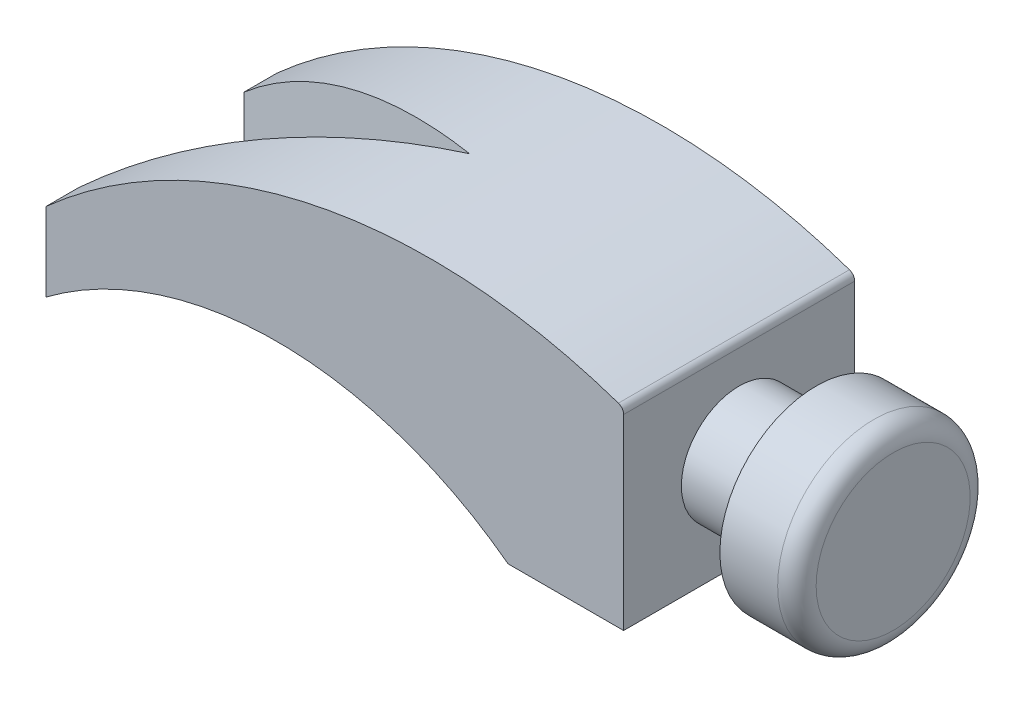
ISO-10303-21;
HEADER;
FILE_DESCRIPTION(('STEP AP214'),'2;1');
FILE_NAME('part.step','',(''),(''),'','','');
FILE_SCHEMA(('AUTOMOTIVE_DESIGN { 1 0 10303 214 1 1 1 1 }'));
ENDSEC;
DATA;
#1=APPLICATION_CONTEXT('core data for automotive mechanical design processes');
#2=APPLICATION_PROTOCOL_DEFINITION('international standard','automotive_design',2000,#1);
#3=PRODUCT_CONTEXT('',#1,'mechanical');
#4=PRODUCT('Part','Part','',(#3));
#5=PRODUCT_RELATED_PRODUCT_CATEGORY('part','',(#4));
#6=PRODUCT_DEFINITION_FORMATION('','',#4);
#7=PRODUCT_DEFINITION_CONTEXT('part definition',#1,'design');
#8=PRODUCT_DEFINITION('design','',#6,#7);
#9=PRODUCT_DEFINITION_SHAPE('','',#8);
#10=(LENGTH_UNIT() NAMED_UNIT(*) SI_UNIT(.MILLI.,.METRE.));
#11=(NAMED_UNIT(*) PLANE_ANGLE_UNIT() SI_UNIT($,.RADIAN.));
#12=(NAMED_UNIT(*) SI_UNIT($,.STERADIAN.) SOLID_ANGLE_UNIT());
#13=UNCERTAINTY_MEASURE_WITH_UNIT(LENGTH_MEASURE(1.E-05),#10,'distance_accuracy_value','');
#14=(GEOMETRIC_REPRESENTATION_CONTEXT(3) GLOBAL_UNCERTAINTY_ASSIGNED_CONTEXT((#13)) GLOBAL_UNIT_ASSIGNED_CONTEXT((#10,
#11,#12)) REPRESENTATION_CONTEXT('',''));
#15=CARTESIAN_POINT('',(0.,0.,0.));
#16=DIRECTION('',(0.,0.,1.));
#17=DIRECTION('',(1.,0.,0.));
#18=AXIS2_PLACEMENT_3D('',#15,#16,#17);
#19=CARTESIAN_POINT('',(0.,30.,30.));
#20=DIRECTION('',(0.,0.,-1.));
#21=DIRECTION('',(-1.,0.,0.));
#22=AXIS2_PLACEMENT_3D('',#19,#20,#21);
#23=PLANE('',#22);
#24=DIRECTION('',(0.,-1.,0.));
#25=VECTOR('',#24,1.);
#26=CARTESIAN_POINT('',(0.,30.,30.));
#27=LINE('',#26,#25);
#28=CARTESIAN_POINT('',(0.,18.5786437626905,30.));
#29=VERTEX_POINT('',#28);
#30=CARTESIAN_POINT('',(0.,-30.,30.));
#31=VERTEX_POINT('',#30);
#32=EDGE_CURVE('E157',#29,#31,#27,.T.);
#33=ORIENTED_EDGE('',*,*,#32,.F.);
#34=CARTESIAN_POINT('',(-2.,18.5786437626905,30.));
#35=DIRECTION('',(0.,0.,-1.));
#36=DIRECTION('',(-1.,0.,0.));
#37=AXIS2_PLACEMENT_3D('',#34,#35,#36);
#38=CIRCLE('',#37,2.);
#39=CARTESIAN_POINT('',(-1.35135135135134,20.4705356545824,30.));
#40=VERTEX_POINT('',#39);
#41=EDGE_CURVE('E68',#29,#40,#38,.F.);
#42=ORIENTED_EDGE('',*,*,#41,.T.);
#43=CARTESIAN_POINT('',(-50.,-121.42135623731,30.));
#44=DIRECTION('',(0.,0.,-1.));
#45=DIRECTION('',(1.,0.,0.));
#46=AXIS2_PLACEMENT_3D('',#43,#44,#45);
#47=CIRCLE('',#46,150.);
#48=CARTESIAN_POINT('',(-150.,-9.61795736232002,30.));
#49=VERTEX_POINT('',#48);
#50=EDGE_CURVE('E116',#49,#40,#47,.T.);
#51=ORIENTED_EDGE('',*,*,#50,.F.);
#52=DIRECTION('',(0.,-1.,0.));
#53=VECTOR('',#52,1.);
#54=CARTESIAN_POINT('',(-150.,30.,30.));
#55=LINE('',#54,#53);
#56=CARTESIAN_POINT('',(-150.,-30.,30.));
#57=VERTEX_POINT('',#56);
#58=EDGE_CURVE('E126',#49,#57,#55,.T.);
#59=ORIENTED_EDGE('',*,*,#58,.T.);
#60=CARTESIAN_POINT('',(-90.,-110.,30.));
#61=DIRECTION('',(0.,0.,1.));
#62=DIRECTION('',(1.,0.,0.));
#63=AXIS2_PLACEMENT_3D('',#60,#61,#62);
#64=CIRCLE('',#63,100.);
#65=CARTESIAN_POINT('',(-30.,-30.,30.));
#66=VERTEX_POINT('',#65);
#67=EDGE_CURVE('E177',#66,#57,#64,.T.);
#68=ORIENTED_EDGE('',*,*,#67,.F.);
#69=DIRECTION('',(1.,0.,0.));
#70=VECTOR('',#69,1.);
#71=CARTESIAN_POINT('',(0.,-30.,30.));
#72=LINE('',#71,#70);
#73=EDGE_CURVE('E175',#66,#31,#72,.T.);
#74=ORIENTED_EDGE('',*,*,#73,.T.);
#75=EDGE_LOOP('',(#33,#42,#51,#59,#68,#74));
#76=FACE_BOUND('',#75,.T.);
#77=ADVANCED_FACE('F45',(#76),#23,.F.);
#78=CARTESIAN_POINT('',(0.,30.,-30.));
#79=DIRECTION('',(-1.,0.,0.));
#80=DIRECTION('',(0.,0.,1.));
#81=AXIS2_PLACEMENT_3D('',#78,#79,#80);
#82=PLANE('',#81);
#83=CARTESIAN_POINT('',(0.,-5.,0.));
#84=DIRECTION('',(-1.,0.,0.));
#85=DIRECTION('',(0.,0.,1.));
#86=AXIS2_PLACEMENT_3D('',#83,#84,#85);
#87=CIRCLE('',#86,15.);
#88=CARTESIAN_POINT('',(0.,-5.,15.));
#89=VERTEX_POINT('',#88);
#90=EDGE_CURVE('E234',#89,#89,#87,.T.);
#91=ORIENTED_EDGE('',*,*,#90,.T.);
#92=EDGE_LOOP('',(#91));
#93=FACE_BOUND('',#92,.T.);
#94=DIRECTION('',(0.,-1.,0.));
#95=VECTOR('',#94,1.);
#96=CARTESIAN_POINT('',(0.,30.,-30.));
#97=LINE('',#96,#95);
#98=CARTESIAN_POINT('',(0.,18.5786437626905,-30.));
#99=VERTEX_POINT('',#98);
#100=CARTESIAN_POINT('',(0.,-30.,-30.));
#101=VERTEX_POINT('',#100);
#102=EDGE_CURVE('E154',#99,#101,#97,.T.);
#103=ORIENTED_EDGE('',*,*,#102,.F.);
#104=DIRECTION('',(0.,0.,1.));
#105=VECTOR('',#104,1.);
#106=CARTESIAN_POINT('',(0.,18.5786437626905,-30.));
#107=LINE('',#106,#105);
#108=EDGE_CURVE('E160',#99,#29,#107,.T.);
#109=ORIENTED_EDGE('',*,*,#108,.T.);
#110=ORIENTED_EDGE('',*,*,#32,.T.);
#111=DIRECTION('',(0.,0.,-1.));
#112=VECTOR('',#111,1.);
#113=CARTESIAN_POINT('',(0.,-30.,-30.));
#114=LINE('',#113,#112);
#115=EDGE_CURVE('E181',#31,#101,#114,.T.);
#116=ORIENTED_EDGE('',*,*,#115,.T.);
#117=EDGE_LOOP('',(#103,#109,#110,#116));
#118=FACE_BOUND('',#117,.T.);
#119=ADVANCED_FACE('F169',(#93,#118),#82,.F.);
#120=CARTESIAN_POINT('',(0.,30.,-30.));
#121=DIRECTION('',(0.,0.,1.));
#122=DIRECTION('',(1.,0.,0.));
#123=AXIS2_PLACEMENT_3D('',#120,#121,#122);
#124=PLANE('',#123);
#125=CARTESIAN_POINT('',(-50.,-121.42135623731,-30.));
#126=DIRECTION('',(0.,0.,1.));
#127=DIRECTION('',(1.,0.,0.));
#128=AXIS2_PLACEMENT_3D('',#125,#126,#127);
#129=CIRCLE('',#128,150.);
#130=CARTESIAN_POINT('',(-1.35135135135134,20.4705356545824,-30.));
#131=VERTEX_POINT('',#130);
#132=CARTESIAN_POINT('',(-150.,-9.61795736232002,-30.));
#133=VERTEX_POINT('',#132);
#134=EDGE_CURVE('E129',#131,#133,#129,.T.);
#135=ORIENTED_EDGE('',*,*,#134,.F.);
#136=CARTESIAN_POINT('',(-2.,18.5786437626905,-30.));
#137=DIRECTION('',(0.,0.,1.));
#138=DIRECTION('',(1.,0.,0.));
#139=AXIS2_PLACEMENT_3D('',#136,#137,#138);
#140=CIRCLE('',#139,2.);
#141=EDGE_CURVE('E11',#131,#99,#140,.F.);
#142=ORIENTED_EDGE('',*,*,#141,.T.);
#143=ORIENTED_EDGE('',*,*,#102,.T.);
#144=DIRECTION('',(-1.,0.,0.));
#145=VECTOR('',#144,1.);
#146=CARTESIAN_POINT('',(0.,-30.,-30.));
#147=LINE('',#146,#145);
#148=CARTESIAN_POINT('',(-30.,-30.,-30.));
#149=VERTEX_POINT('',#148);
#150=EDGE_CURVE('E187',#101,#149,#147,.T.);
#151=ORIENTED_EDGE('',*,*,#150,.T.);
#152=CARTESIAN_POINT('',(-90.,-110.,-30.));
#153=DIRECTION('',(0.,0.,1.));
#154=DIRECTION('',(1.,0.,0.));
#155=AXIS2_PLACEMENT_3D('',#152,#153,#154);
#156=CIRCLE('',#155,100.);
#157=CARTESIAN_POINT('',(-150.,-30.,-30.));
#158=VERTEX_POINT('',#157);
#159=EDGE_CURVE('E205',#158,#149,#156,.F.);
#160=ORIENTED_EDGE('',*,*,#159,.F.);
#161=DIRECTION('',(0.,-1.,0.));
#162=VECTOR('',#161,1.);
#163=CARTESIAN_POINT('',(-150.,30.,-30.));
#164=LINE('',#163,#162);
#165=EDGE_CURVE('E151',#133,#158,#164,.T.);
#166=ORIENTED_EDGE('',*,*,#165,.F.);
#167=EDGE_LOOP('',(#135,#142,#143,#151,#160,#166));
#168=FACE_BOUND('',#167,.T.);
#169=ADVANCED_FACE('F210',(#168),#124,.F.);
#170=CARTESIAN_POINT('',(-150.,30.,-30.));
#171=DIRECTION('',(1.,0.,0.));
#172=DIRECTION('',(0.,0.,-1.));
#173=AXIS2_PLACEMENT_3D('',#170,#171,#172);
#174=PLANE('',#173);
#175=DIRECTION('',(0.,-1.,0.));
#176=VECTOR('',#175,1.);
#177=CARTESIAN_POINT('',(-150.,30.,-21.4359353944899));
#178=LINE('',#177,#176);
#179=CARTESIAN_POINT('',(-150.,-9.61795736232002,-21.4359353944899));
#180=VERTEX_POINT('',#179);
#181=CARTESIAN_POINT('',(-150.,-30.,-21.4359353944899));
#182=VERTEX_POINT('',#181);
#183=EDGE_CURVE('E148',#180,#182,#178,.T.);
#184=ORIENTED_EDGE('',*,*,#183,.F.);
#185=DIRECTION('',(0.,0.,1.));
#186=VECTOR('',#185,1.);
#187=CARTESIAN_POINT('',(-150.,-9.61795736232002,-30.001));
#188=LINE('',#187,#186);
#189=EDGE_CURVE('E123',#133,#180,#188,.T.);
#190=ORIENTED_EDGE('',*,*,#189,.F.);
#191=ORIENTED_EDGE('',*,*,#165,.T.);
#192=DIRECTION('',(0.,0.,1.));
#193=VECTOR('',#192,1.);
#194=CARTESIAN_POINT('',(-150.,-30.,-30.));
#195=LINE('',#194,#193);
#196=EDGE_CURVE('E142',#158,#182,#195,.T.);
#197=ORIENTED_EDGE('',*,*,#196,.T.);
#198=EDGE_LOOP('',(#184,#190,#191,#197));
#199=FACE_BOUND('',#198,.T.);
#200=ADVANCED_FACE('F198',(#199),#174,.F.);
#201=CARTESIAN_POINT('',(-150.,30.,-21.4359353944899));
#202=DIRECTION('',(0.258819045102522,0.,-0.965925826289068));
#203=DIRECTION('',(-0.965925826289068,0.,-0.258819045102522));
#204=AXIS2_PLACEMENT_3D('',#201,#202,#203);
#205=PLANE('',#204);
#206=DIRECTION('',(0.,-1.,0.));
#207=VECTOR('',#206,1.);
#208=CARTESIAN_POINT('',(-70.,30.,0.));
#209=LINE('',#208,#207);
#210=CARTESIAN_POINT('',(-70.,27.2393312358756,0.));
#211=VERTEX_POINT('',#210);
#212=CARTESIAN_POINT('',(-70.,-12.0204102886728,0.));
#213=VERTEX_POINT('',#212);
#214=EDGE_CURVE('E140',#211,#213,#209,.T.);
#215=ORIENTED_EDGE('',*,*,#214,.F.);
#216=CARTESIAN_POINT('',(-50.,-121.42135623731,5.35898384862248));
#217=DIRECTION('',(0.258819045102522,0.,-0.965925826289068));
#218=DIRECTION('',(0.965925826289068,0.,0.258819045102522));
#219=AXIS2_PLACEMENT_3D('',#216,#217,#218);
#220=ELLIPSE('',#219,155.291427061512,150.);
#221=EDGE_CURVE('E248',#180,#211,#220,.T.);
#222=ORIENTED_EDGE('',*,*,#221,.F.);
#223=ORIENTED_EDGE('',*,*,#183,.T.);
#224=CARTESIAN_POINT('',(-90.,-110.,-5.35898384862247));
#225=DIRECTION('',(0.258819045102522,0.,-0.965925826289068));
#226=DIRECTION('',(0.965925826289068,0.,0.258819045102522));
#227=AXIS2_PLACEMENT_3D('',#224,#225,#226);
#228=ELLIPSE('',#227,103.527618041008,100.);
#229=EDGE_CURVE('E208',#213,#182,#228,.F.);
#230=ORIENTED_EDGE('',*,*,#229,.F.);
#231=EDGE_LOOP('',(#215,#222,#223,#230));
#232=FACE_BOUND('',#231,.T.);
#233=ADVANCED_FACE('F255',(#232),#205,.F.);
#234=CARTESIAN_POINT('',(-150.,30.,21.4359353944899));
#235=DIRECTION('',(0.258819045102522,0.,0.965925826289068));
#236=DIRECTION('',(0.965925826289068,0.,-0.258819045102522));
#237=AXIS2_PLACEMENT_3D('',#234,#235,#236);
#238=PLANE('',#237);
#239=DIRECTION('',(0.,-1.,0.));
#240=VECTOR('',#239,1.);
#241=CARTESIAN_POINT('',(-150.,30.,21.4359353944899));
#242=LINE('',#241,#240);
#243=CARTESIAN_POINT('',(-150.,-9.61795736232004,21.4359353944899));
#244=VERTEX_POINT('',#243);
#245=CARTESIAN_POINT('',(-150.,-30.,21.4359353944899));
#246=VERTEX_POINT('',#245);
#247=EDGE_CURVE('E136',#244,#246,#242,.T.);
#248=ORIENTED_EDGE('',*,*,#247,.F.);
#249=CARTESIAN_POINT('',(-50.,-121.42135623731,-5.35898384862246));
#250=DIRECTION('',(0.258819045102522,0.,0.965925826289068));
#251=DIRECTION('',(-0.965925826289068,0.,0.258819045102522));
#252=AXIS2_PLACEMENT_3D('',#249,#250,#251);
#253=ELLIPSE('',#252,155.291427061513,150.);
#254=EDGE_CURVE('E118',#211,#244,#253,.T.);
#255=ORIENTED_EDGE('',*,*,#254,.F.);
#256=ORIENTED_EDGE('',*,*,#214,.T.);
#257=CARTESIAN_POINT('',(-90.,-110.,5.3589838486225));
#258=DIRECTION('',(0.258819045102522,0.,0.965925826289068));
#259=DIRECTION('',(-0.965925826289068,0.,0.258819045102522));
#260=AXIS2_PLACEMENT_3D('',#257,#258,#259);
#261=ELLIPSE('',#260,103.527618041008,100.);
#262=EDGE_CURVE('E216',#246,#213,#261,.F.);
#263=ORIENTED_EDGE('',*,*,#262,.F.);
#264=EDGE_LOOP('',(#248,#255,#256,#263));
#265=FACE_BOUND('',#264,.T.);
#266=ADVANCED_FACE('F222',(#265),#238,.F.);
#267=CARTESIAN_POINT('',(-150.,30.,30.));
#268=DIRECTION('',(1.,0.,0.));
#269=DIRECTION('',(0.,0.,-1.));
#270=AXIS2_PLACEMENT_3D('',#267,#268,#269);
#271=PLANE('',#270);
#272=ORIENTED_EDGE('',*,*,#58,.F.);
#273=EDGE_CURVE('E114',#244,#49,#188,.T.);
#274=ORIENTED_EDGE('',*,*,#273,.F.);
#275=ORIENTED_EDGE('',*,*,#247,.T.);
#276=DIRECTION('',(0.,0.,1.));
#277=VECTOR('',#276,1.);
#278=CARTESIAN_POINT('',(-150.,-30.,30.));
#279=LINE('',#278,#277);
#280=EDGE_CURVE('E134',#246,#57,#279,.T.);
#281=ORIENTED_EDGE('',*,*,#280,.T.);
#282=EDGE_LOOP('',(#272,#274,#275,#281));
#283=FACE_BOUND('',#282,.T.);
#284=ADVANCED_FACE('F132',(#283),#271,.F.);
#285=CARTESIAN_POINT('',(0.,-30.,0.));
#286=DIRECTION('',(0.,-1.,0.));
#287=DIRECTION('',(0.,0.,-1.));
#288=AXIS2_PLACEMENT_3D('',#285,#286,#287);
#289=PLANE('',#288);
#290=DIRECTION('',(0.,0.,1.));
#291=VECTOR('',#290,1.);
#292=CARTESIAN_POINT('',(-30.,-30.,-30.001));
#293=LINE('',#292,#291);
#294=EDGE_CURVE('E182',#149,#66,#293,.T.);
#295=ORIENTED_EDGE('',*,*,#294,.F.);
#296=ORIENTED_EDGE('',*,*,#150,.F.);
#297=ORIENTED_EDGE('',*,*,#115,.F.);
#298=ORIENTED_EDGE('',*,*,#73,.F.);
#299=EDGE_LOOP('',(#295,#296,#297,#298));
#300=FACE_BOUND('',#299,.T.);
#301=ADVANCED_FACE('F185',(#300),#289,.T.);
#302=CARTESIAN_POINT('',(-90.,-110.,-30.001));
#303=DIRECTION('',(0.,0.,1.));
#304=DIRECTION('',(1.,0.,0.));
#305=AXIS2_PLACEMENT_3D('',#302,#303,#304);
#306=CYLINDRICAL_SURFACE('',#305,100.);
#307=ORIENTED_EDGE('',*,*,#159,.T.);
#308=ORIENTED_EDGE('',*,*,#294,.T.);
#309=ORIENTED_EDGE('',*,*,#67,.T.);
#310=ORIENTED_EDGE('',*,*,#280,.F.);
#311=ORIENTED_EDGE('',*,*,#262,.T.);
#312=ORIENTED_EDGE('',*,*,#229,.T.);
#313=ORIENTED_EDGE('',*,*,#196,.F.);
#314=EDGE_LOOP('',(#307,#308,#309,#310,#311,#312,#313));
#315=FACE_BOUND('',#314,.T.);
#316=ADVANCED_FACE('F204',(#315),#306,.F.);
#317=CARTESIAN_POINT('',(0.,-5.,0.));
#318=DIRECTION('',(-1.,0.,0.));
#319=DIRECTION('',(0.,0.,1.));
#320=AXIS2_PLACEMENT_3D('',#317,#318,#319);
#321=CYLINDRICAL_SURFACE('',#320,25.);
#322=CARTESIAN_POINT('',(35.,-5.,0.));
#323=DIRECTION('',(-1.,0.,0.));
#324=DIRECTION('',(0.,0.,1.));
#325=AXIS2_PLACEMENT_3D('',#322,#323,#324);
#326=CIRCLE('',#325,25.);
#327=CARTESIAN_POINT('',(35.,-5.,25.));
#328=VERTEX_POINT('',#327);
#329=EDGE_CURVE('E225',#328,#328,#326,.T.);
#330=ORIENTED_EDGE('',*,*,#329,.T.);
#331=EDGE_LOOP('',(#330));
#332=FACE_BOUND('',#331,.T.);
#333=CARTESIAN_POINT('',(20.,-5.,0.));
#334=DIRECTION('',(-1.,0.,0.));
#335=DIRECTION('',(0.,0.,1.));
#336=AXIS2_PLACEMENT_3D('',#333,#334,#335);
#337=CIRCLE('',#336,25.);
#338=CARTESIAN_POINT('',(20.,-5.,25.));
#339=VERTEX_POINT('',#338);
#340=EDGE_CURVE('E242',#339,#339,#337,.T.);
#341=ORIENTED_EDGE('',*,*,#340,.F.);
#342=EDGE_LOOP('',(#341));
#343=FACE_BOUND('',#342,.T.);
#344=ADVANCED_FACE('F345',(#332,#343),#321,.T.);
#345=CARTESIAN_POINT('',(35.,-5.,0.));
#346=DIRECTION('',(-1.,0.,0.));
#347=DIRECTION('',(0.,0.,1.));
#348=AXIS2_PLACEMENT_3D('',#345,#346,#347);
#349=TOROIDAL_SURFACE('',#348,20.,5.);
#350=CARTESIAN_POINT('',(40.,-5.,0.));
#351=DIRECTION('',(-1.,0.,0.));
#352=DIRECTION('',(0.,0.,1.));
#353=AXIS2_PLACEMENT_3D('',#350,#351,#352);
#354=CIRCLE('',#353,20.);
#355=CARTESIAN_POINT('',(40.,-5.,20.));
#356=VERTEX_POINT('',#355);
#357=EDGE_CURVE('E228',#356,#356,#354,.T.);
#358=ORIENTED_EDGE('',*,*,#357,.T.);
#359=EDGE_LOOP('',(#358));
#360=FACE_BOUND('',#359,.T.);
#361=ORIENTED_EDGE('',*,*,#329,.F.);
#362=EDGE_LOOP('',(#361));
#363=FACE_BOUND('',#362,.T.);
#364=ADVANCED_FACE('F354',(#360,#363),#349,.T.);
#365=CARTESIAN_POINT('',(40.,0.,0.));
#366=DIRECTION('',(1.,0.,0.));
#367=DIRECTION('',(0.,0.,-1.));
#368=AXIS2_PLACEMENT_3D('',#365,#366,#367);
#369=PLANE('',#368);
#370=ORIENTED_EDGE('',*,*,#357,.F.);
#371=EDGE_LOOP('',(#370));
#372=FACE_BOUND('',#371,.T.);
#373=ADVANCED_FACE('F364',(#372),#369,.T.);
#374=CARTESIAN_POINT('',(0.,-5.,0.));
#375=DIRECTION('',(-1.,0.,0.));
#376=DIRECTION('',(0.,0.,1.));
#377=AXIS2_PLACEMENT_3D('',#374,#375,#376);
#378=CYLINDRICAL_SURFACE('',#377,15.);
#379=CARTESIAN_POINT('',(20.,-5.,0.));
#380=DIRECTION('',(-1.,0.,0.));
#381=DIRECTION('',(0.,0.,1.));
#382=AXIS2_PLACEMENT_3D('',#379,#380,#381);
#383=CIRCLE('',#382,15.);
#384=CARTESIAN_POINT('',(20.,-5.,15.));
#385=VERTEX_POINT('',#384);
#386=EDGE_CURVE('E238',#385,#385,#383,.T.);
#387=ORIENTED_EDGE('',*,*,#386,.T.);
#388=EDGE_LOOP('',(#387));
#389=FACE_BOUND('',#388,.T.);
#390=ORIENTED_EDGE('',*,*,#90,.F.);
#391=EDGE_LOOP('',(#390));
#392=FACE_BOUND('',#391,.T.);
#393=ADVANCED_FACE('F374',(#389,#392),#378,.T.);
#394=CARTESIAN_POINT('',(20.,0.,0.));
#395=DIRECTION('',(-1.,0.,0.));
#396=DIRECTION('',(0.,0.,1.));
#397=AXIS2_PLACEMENT_3D('',#394,#395,#396);
#398=PLANE('',#397);
#399=ORIENTED_EDGE('',*,*,#340,.T.);
#400=EDGE_LOOP('',(#399));
#401=FACE_BOUND('',#400,.T.);
#402=ORIENTED_EDGE('',*,*,#386,.F.);
#403=EDGE_LOOP('',(#402));
#404=FACE_BOUND('',#403,.T.);
#405=ADVANCED_FACE('F288',(#401,#404),#398,.T.);
#406=CARTESIAN_POINT('',(-50.,-121.42135623731,-30.001));
#407=DIRECTION('',(0.,0.,1.));
#408=DIRECTION('',(1.,0.,0.));
#409=AXIS2_PLACEMENT_3D('',#406,#407,#408);
#410=CYLINDRICAL_SURFACE('',#409,150.);
#411=ORIENTED_EDGE('',*,*,#50,.T.);
#412=DIRECTION('',(0.,0.,1.));
#413=VECTOR('',#412,1.);
#414=CARTESIAN_POINT('',(-1.35135135135134,20.4705356545824,-30.001));
#415=LINE('',#414,#413);
#416=EDGE_CURVE('E54',#40,#131,#415,.F.);
#417=ORIENTED_EDGE('',*,*,#416,.T.);
#418=ORIENTED_EDGE('',*,*,#134,.T.);
#419=ORIENTED_EDGE('',*,*,#189,.T.);
#420=ORIENTED_EDGE('',*,*,#221,.T.);
#421=ORIENTED_EDGE('',*,*,#254,.T.);
#422=ORIENTED_EDGE('',*,*,#273,.T.);
#423=EDGE_LOOP('',(#411,#417,#418,#419,#420,#421,#422));
#424=FACE_BOUND('',#423,.T.);
#425=ADVANCED_FACE('F115',(#424),#410,.T.);
#426=CARTESIAN_POINT('',(-2.,18.5786437626905,-30.001));
#427=DIRECTION('',(0.,0.,1.));
#428=DIRECTION('',(1.,0.,0.));
#429=AXIS2_PLACEMENT_3D('',#426,#427,#428);
#430=CYLINDRICAL_SURFACE('',#429,2.);
#431=ORIENTED_EDGE('',*,*,#141,.F.);
#432=ORIENTED_EDGE('',*,*,#416,.F.);
#433=ORIENTED_EDGE('',*,*,#41,.F.);
#434=ORIENTED_EDGE('',*,*,#108,.F.);
#435=EDGE_LOOP('',(#431,#432,#433,#434));
#436=FACE_BOUND('',#435,.T.);
#437=ADVANCED_FACE('F47',(#436),#430,.T.);
#438=CLOSED_SHELL('',(#77,#119,#169,#200,#233,#266,#284,#301,#316,#344,#364,#373,#393,#405,#425,#437));
#439=MANIFOLD_SOLID_BREP('B2',#438);
#440=ADVANCED_BREP_SHAPE_REPRESENTATION('',(#18,#439),#14);
#441=SHAPE_DEFINITION_REPRESENTATION(#9,#440);
ENDSEC;
END-ISO-10303-21;
